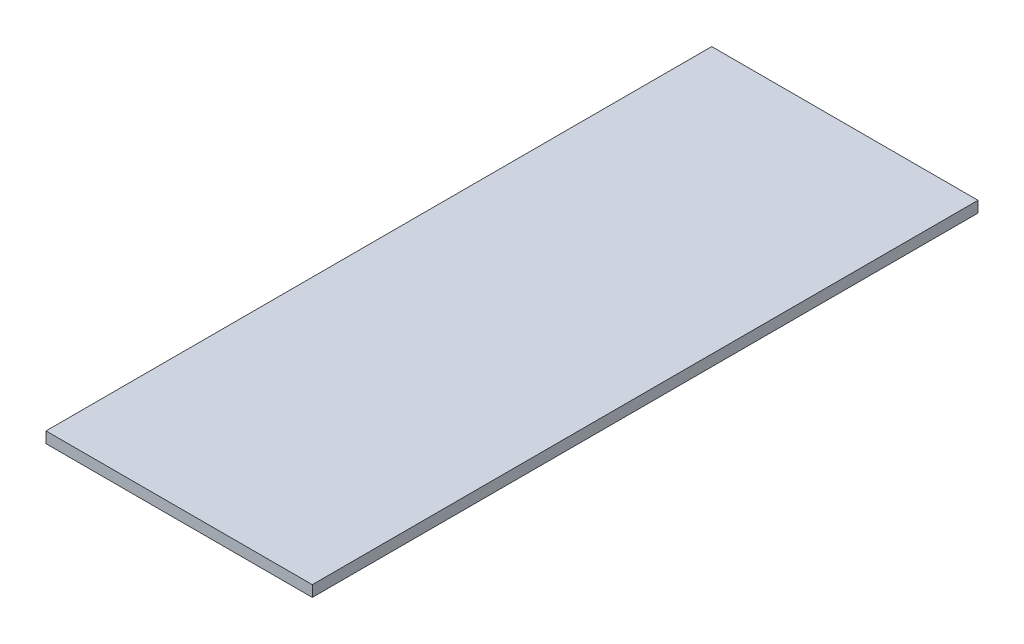
ISO-10303-21;
HEADER;
FILE_DESCRIPTION(('STEP AP214'),'2;1');
FILE_NAME('part.step','',(''),(''),'','','');
FILE_SCHEMA(('AUTOMOTIVE_DESIGN { 1 0 10303 214 1 1 1 1 }'));
ENDSEC;
DATA;
#1=APPLICATION_CONTEXT('core data for automotive mechanical design processes');
#2=APPLICATION_PROTOCOL_DEFINITION('international standard','automotive_design',2000,#1);
#3=PRODUCT_CONTEXT('',#1,'mechanical');
#4=PRODUCT('Part','Part','',(#3));
#5=PRODUCT_RELATED_PRODUCT_CATEGORY('part','',(#4));
#6=PRODUCT_DEFINITION_FORMATION('','',#4);
#7=PRODUCT_DEFINITION_CONTEXT('part definition',#1,'design');
#8=PRODUCT_DEFINITION('design','',#6,#7);
#9=PRODUCT_DEFINITION_SHAPE('','',#8);
#10=(LENGTH_UNIT() NAMED_UNIT(*) SI_UNIT(.MILLI.,.METRE.));
#11=(NAMED_UNIT(*) PLANE_ANGLE_UNIT() SI_UNIT($,.RADIAN.));
#12=(NAMED_UNIT(*) SI_UNIT($,.STERADIAN.) SOLID_ANGLE_UNIT());
#13=UNCERTAINTY_MEASURE_WITH_UNIT(LENGTH_MEASURE(1.E-05),#10,'distance_accuracy_value','');
#14=(GEOMETRIC_REPRESENTATION_CONTEXT(3) GLOBAL_UNCERTAINTY_ASSIGNED_CONTEXT((#13)) GLOBAL_UNIT_ASSIGNED_CONTEXT((#10,
#11,#12)) REPRESENTATION_CONTEXT('',''));
#15=CARTESIAN_POINT('',(0.,0.,0.));
#16=DIRECTION('',(0.,0.,1.));
#17=DIRECTION('',(1.,0.,0.));
#18=AXIS2_PLACEMENT_3D('',#15,#16,#17);
#19=CARTESIAN_POINT('',(0.,6.35,0.));
#20=DIRECTION('',(1.,0.,0.));
#21=DIRECTION('',(0.,0.,-1.));
#22=AXIS2_PLACEMENT_3D('',#19,#20,#21);
#23=PLANE('',#22);
#24=DIRECTION('',(0.,0.,1.));
#25=VECTOR('',#24,1.);
#26=CARTESIAN_POINT('',(0.,0.,0.));
#27=LINE('',#26,#25);
#28=CARTESIAN_POINT('',(0.,0.,-381.));
#29=VERTEX_POINT('',#28);
#30=CARTESIAN_POINT('',(0.,0.,0.));
#31=VERTEX_POINT('',#30);
#32=EDGE_CURVE('E97',#29,#31,#27,.T.);
#33=ORIENTED_EDGE('',*,*,#32,.T.);
#34=DIRECTION('',(0.,-1.,0.));
#35=VECTOR('',#34,1.);
#36=CARTESIAN_POINT('',(0.,6.35,0.));
#37=LINE('',#36,#35);
#38=CARTESIAN_POINT('',(0.,6.35,0.));
#39=VERTEX_POINT('',#38);
#40=EDGE_CURVE('E11',#39,#31,#37,.T.);
#41=ORIENTED_EDGE('',*,*,#40,.F.);
#42=DIRECTION('',(0.,0.,1.));
#43=VECTOR('',#42,1.);
#44=CARTESIAN_POINT('',(0.,6.35,0.));
#45=LINE('',#44,#43);
#46=CARTESIAN_POINT('',(0.,6.35,-381.));
#47=VERTEX_POINT('',#46);
#48=EDGE_CURVE('E85',#47,#39,#45,.T.);
#49=ORIENTED_EDGE('',*,*,#48,.F.);
#50=DIRECTION('',(0.,-1.,0.));
#51=VECTOR('',#50,1.);
#52=CARTESIAN_POINT('',(0.,6.35,-381.));
#53=LINE('',#52,#51);
#54=EDGE_CURVE('E93',#47,#29,#53,.T.);
#55=ORIENTED_EDGE('',*,*,#54,.T.);
#56=EDGE_LOOP('',(#33,#41,#49,#55));
#57=FACE_BOUND('',#56,.T.);
#58=ADVANCED_FACE('F34',(#57),#23,.F.);
#59=CARTESIAN_POINT('',(0.,6.35,0.));
#60=DIRECTION('',(0.,0.,-1.));
#61=DIRECTION('',(-1.,0.,0.));
#62=AXIS2_PLACEMENT_3D('',#59,#60,#61);
#63=PLANE('',#62);
#64=DIRECTION('',(1.,0.,0.));
#65=VECTOR('',#64,1.);
#66=CARTESIAN_POINT('',(0.,0.,0.));
#67=LINE('',#66,#65);
#68=CARTESIAN_POINT('',(152.4,0.,0.));
#69=VERTEX_POINT('',#68);
#70=EDGE_CURVE('E89',#31,#69,#67,.T.);
#71=ORIENTED_EDGE('',*,*,#70,.T.);
#72=DIRECTION('',(0.,-1.,0.));
#73=VECTOR('',#72,1.);
#74=CARTESIAN_POINT('',(152.4,6.35,0.));
#75=LINE('',#74,#73);
#76=CARTESIAN_POINT('',(152.4,6.35,0.));
#77=VERTEX_POINT('',#76);
#78=EDGE_CURVE('E42',#77,#69,#75,.T.);
#79=ORIENTED_EDGE('',*,*,#78,.F.);
#80=DIRECTION('',(1.,0.,0.));
#81=VECTOR('',#80,1.);
#82=CARTESIAN_POINT('',(0.,6.35,0.));
#83=LINE('',#82,#81);
#84=EDGE_CURVE('E80',#39,#77,#83,.T.);
#85=ORIENTED_EDGE('',*,*,#84,.F.);
#86=ORIENTED_EDGE('',*,*,#40,.T.);
#87=EDGE_LOOP('',(#71,#79,#85,#86));
#88=FACE_BOUND('',#87,.T.);
#89=ADVANCED_FACE('F88',(#88),#63,.F.);
#90=CARTESIAN_POINT('',(152.4,6.35,0.));
#91=DIRECTION('',(-1.,0.,0.));
#92=DIRECTION('',(0.,0.,1.));
#93=AXIS2_PLACEMENT_3D('',#90,#91,#92);
#94=PLANE('',#93);
#95=DIRECTION('',(0.,0.,-1.));
#96=VECTOR('',#95,1.);
#97=CARTESIAN_POINT('',(152.4,0.,0.));
#98=LINE('',#97,#96);
#99=CARTESIAN_POINT('',(152.4,0.,-381.));
#100=VERTEX_POINT('',#99);
#101=EDGE_CURVE('E67',#69,#100,#98,.T.);
#102=ORIENTED_EDGE('',*,*,#101,.T.);
#103=DIRECTION('',(0.,-1.,0.));
#104=VECTOR('',#103,1.);
#105=CARTESIAN_POINT('',(152.4,6.35,-381.));
#106=LINE('',#105,#104);
#107=CARTESIAN_POINT('',(152.4,6.35,-381.));
#108=VERTEX_POINT('',#107);
#109=EDGE_CURVE('E90',#108,#100,#106,.T.);
#110=ORIENTED_EDGE('',*,*,#109,.F.);
#111=DIRECTION('',(0.,0.,-1.));
#112=VECTOR('',#111,1.);
#113=CARTESIAN_POINT('',(152.4,6.35,0.));
#114=LINE('',#113,#112);
#115=EDGE_CURVE('E83',#77,#108,#114,.T.);
#116=ORIENTED_EDGE('',*,*,#115,.F.);
#117=ORIENTED_EDGE('',*,*,#78,.T.);
#118=EDGE_LOOP('',(#102,#110,#116,#117));
#119=FACE_BOUND('',#118,.T.);
#120=ADVANCED_FACE('F91',(#119),#94,.F.);
#121=CARTESIAN_POINT('',(0.,6.35,-381.));
#122=DIRECTION('',(0.,0.,1.));
#123=DIRECTION('',(1.,0.,0.));
#124=AXIS2_PLACEMENT_3D('',#121,#122,#123);
#125=PLANE('',#124);
#126=DIRECTION('',(-1.,0.,0.));
#127=VECTOR('',#126,1.);
#128=CARTESIAN_POINT('',(0.,0.,-381.));
#129=LINE('',#128,#127);
#130=EDGE_CURVE('E73',#100,#29,#129,.T.);
#131=ORIENTED_EDGE('',*,*,#130,.T.);
#132=ORIENTED_EDGE('',*,*,#54,.F.);
#133=DIRECTION('',(-1.,0.,0.));
#134=VECTOR('',#133,1.);
#135=CARTESIAN_POINT('',(0.,6.35,-381.));
#136=LINE('',#135,#134);
#137=EDGE_CURVE('E50',#108,#47,#136,.T.);
#138=ORIENTED_EDGE('',*,*,#137,.F.);
#139=ORIENTED_EDGE('',*,*,#109,.T.);
#140=EDGE_LOOP('',(#131,#132,#138,#139));
#141=FACE_BOUND('',#140,.T.);
#142=ADVANCED_FACE('F104',(#141),#125,.F.);
#143=CARTESIAN_POINT('',(0.,6.35,-381.));
#144=DIRECTION('',(0.,-1.,0.));
#145=DIRECTION('',(0.,0.,-1.));
#146=AXIS2_PLACEMENT_3D('',#143,#144,#145);
#147=PLANE('',#146);
#148=ORIENTED_EDGE('',*,*,#48,.T.);
#149=ORIENTED_EDGE('',*,*,#84,.T.);
#150=ORIENTED_EDGE('',*,*,#115,.T.);
#151=ORIENTED_EDGE('',*,*,#137,.T.);
#152=EDGE_LOOP('',(#148,#149,#150,#151));
#153=FACE_BOUND('',#152,.T.);
#154=ADVANCED_FACE('F81',(#153),#147,.F.);
#155=CARTESIAN_POINT('',(0.,0.,-381.));
#156=DIRECTION('',(0.,-1.,0.));
#157=DIRECTION('',(0.,0.,-1.));
#158=AXIS2_PLACEMENT_3D('',#155,#156,#157);
#159=PLANE('',#158);
#160=ORIENTED_EDGE('',*,*,#32,.F.);
#161=ORIENTED_EDGE('',*,*,#130,.F.);
#162=ORIENTED_EDGE('',*,*,#101,.F.);
#163=ORIENTED_EDGE('',*,*,#70,.F.);
#164=EDGE_LOOP('',(#160,#161,#162,#163));
#165=FACE_BOUND('',#164,.T.);
#166=ADVANCED_FACE('F107',(#165),#159,.T.);
#167=CLOSED_SHELL('',(#58,#89,#120,#142,#154,#166));
#168=MANIFOLD_SOLID_BREP('B2',#167);
#169=ADVANCED_BREP_SHAPE_REPRESENTATION('',(#18,#168),#14);
#170=SHAPE_DEFINITION_REPRESENTATION(#9,#169);
ENDSEC;
END-ISO-10303-21;
